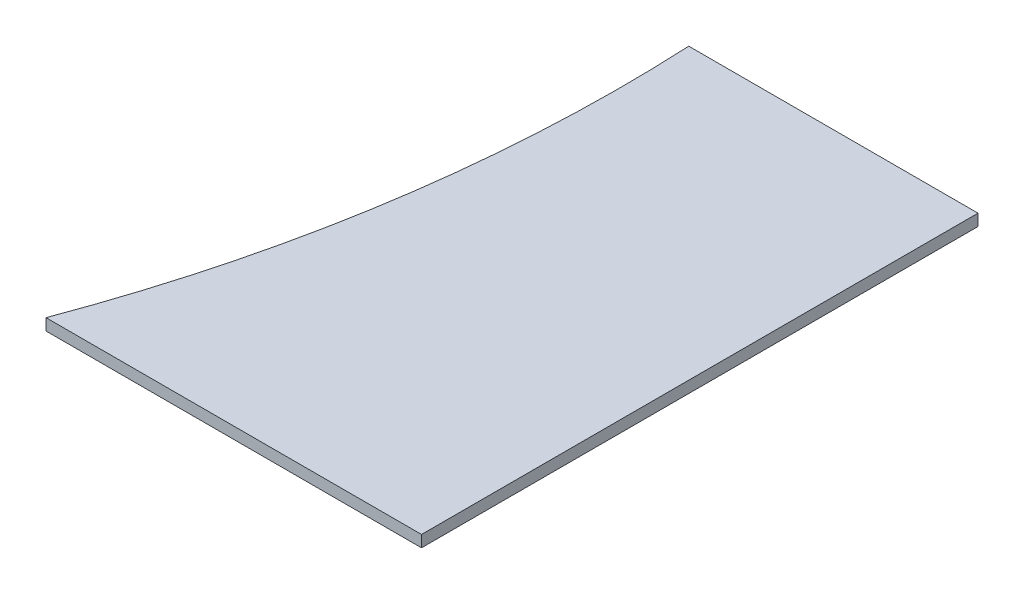
ISO-10303-21;
HEADER;
FILE_DESCRIPTION(('STEP AP214'),'2;1');
FILE_NAME('part.step','',(''),(''),'','','');
FILE_SCHEMA(('AUTOMOTIVE_DESIGN { 1 0 10303 214 1 1 1 1 }'));
ENDSEC;
DATA;
#1=APPLICATION_CONTEXT('core data for automotive mechanical design processes');
#2=APPLICATION_PROTOCOL_DEFINITION('international standard','automotive_design',2000,#1);
#3=PRODUCT_CONTEXT('',#1,'mechanical');
#4=PRODUCT('Part','Part','',(#3));
#5=PRODUCT_RELATED_PRODUCT_CATEGORY('part','',(#4));
#6=PRODUCT_DEFINITION_FORMATION('','',#4);
#7=PRODUCT_DEFINITION_CONTEXT('part definition',#1,'design');
#8=PRODUCT_DEFINITION('design','',#6,#7);
#9=PRODUCT_DEFINITION_SHAPE('','',#8);
#10=(LENGTH_UNIT() NAMED_UNIT(*) SI_UNIT(.MILLI.,.METRE.));
#11=(NAMED_UNIT(*) PLANE_ANGLE_UNIT() SI_UNIT($,.RADIAN.));
#12=(NAMED_UNIT(*) SI_UNIT($,.STERADIAN.) SOLID_ANGLE_UNIT());
#13=UNCERTAINTY_MEASURE_WITH_UNIT(LENGTH_MEASURE(1.E-05),#10,'distance_accuracy_value','');
#14=(GEOMETRIC_REPRESENTATION_CONTEXT(3) GLOBAL_UNCERTAINTY_ASSIGNED_CONTEXT((#13)) GLOBAL_UNIT_ASSIGNED_CONTEXT((#10,
#11,#12)) REPRESENTATION_CONTEXT('',''));
#15=CARTESIAN_POINT('',(0.,0.,0.));
#16=DIRECTION('',(0.,0.,1.));
#17=DIRECTION('',(1.,0.,0.));
#18=AXIS2_PLACEMENT_3D('',#15,#16,#17);
#19=CARTESIAN_POINT('',(39.37,3.175,76.2));
#20=DIRECTION('',(-1.,0.,0.));
#21=DIRECTION('',(0.,0.,1.));
#22=AXIS2_PLACEMENT_3D('',#19,#20,#21);
#23=PLANE('',#22);
#24=DIRECTION('',(0.,0.,-1.));
#25=VECTOR('',#24,1.);
#26=CARTESIAN_POINT('',(39.37,0.,76.2));
#27=LINE('',#26,#25);
#28=CARTESIAN_POINT('',(39.37,0.,76.2));
#29=VERTEX_POINT('',#28);
#30=CARTESIAN_POINT('',(39.37,0.,-76.2));
#31=VERTEX_POINT('',#30);
#32=EDGE_CURVE('E108',#29,#31,#27,.T.);
#33=ORIENTED_EDGE('',*,*,#32,.T.);
#34=DIRECTION('',(0.,-1.,0.));
#35=VECTOR('',#34,1.);
#36=CARTESIAN_POINT('',(39.37,3.175,-76.2));
#37=LINE('',#36,#35);
#38=CARTESIAN_POINT('',(39.37,3.175,-76.2));
#39=VERTEX_POINT('',#38);
#40=EDGE_CURVE('E11',#39,#31,#37,.T.);
#41=ORIENTED_EDGE('',*,*,#40,.F.);
#42=DIRECTION('',(0.,0.,-1.));
#43=VECTOR('',#42,1.);
#44=CARTESIAN_POINT('',(39.37,3.175,76.2));
#45=LINE('',#44,#43);
#46=CARTESIAN_POINT('',(39.37,3.175,76.2));
#47=VERTEX_POINT('',#46);
#48=EDGE_CURVE('E90',#47,#39,#45,.T.);
#49=ORIENTED_EDGE('',*,*,#48,.F.);
#50=DIRECTION('',(0.,-1.,0.));
#51=VECTOR('',#50,1.);
#52=CARTESIAN_POINT('',(39.37,3.175,76.2));
#53=LINE('',#52,#51);
#54=EDGE_CURVE('E104',#47,#29,#53,.T.);
#55=ORIENTED_EDGE('',*,*,#54,.T.);
#56=EDGE_LOOP('',(#33,#41,#49,#55));
#57=FACE_BOUND('',#56,.T.);
#58=ADVANCED_FACE('F39',(#57),#23,.F.);
#59=CARTESIAN_POINT('',(-39.37,3.175,-76.2));
#60=DIRECTION('',(0.,0.,1.));
#61=DIRECTION('',(1.,0.,0.));
#62=AXIS2_PLACEMENT_3D('',#59,#60,#61);
#63=PLANE('',#62);
#64=DIRECTION('',(-1.,0.,0.));
#65=VECTOR('',#64,1.);
#66=CARTESIAN_POINT('',(-39.37,0.,-76.2));
#67=LINE('',#66,#65);
#68=CARTESIAN_POINT('',(-39.8465480289027,0.,-76.2));
#69=VERTEX_POINT('',#68);
#70=EDGE_CURVE('E96',#31,#69,#67,.T.);
#71=ORIENTED_EDGE('',*,*,#70,.T.);
#72=DIRECTION('',(0.,-1.,0.));
#73=VECTOR('',#72,1.);
#74=CARTESIAN_POINT('',(-39.8465480289027,3.175,-76.2));
#75=LINE('',#74,#73);
#76=CARTESIAN_POINT('',(-39.8465480289027,3.175,-76.2));
#77=VERTEX_POINT('',#76);
#78=EDGE_CURVE('E48',#77,#69,#75,.T.);
#79=ORIENTED_EDGE('',*,*,#78,.F.);
#80=DIRECTION('',(-1.,0.,0.));
#81=VECTOR('',#80,1.);
#82=CARTESIAN_POINT('',(-39.37,3.175,-76.2));
#83=LINE('',#82,#81);
#84=EDGE_CURVE('E84',#39,#77,#83,.T.);
#85=ORIENTED_EDGE('',*,*,#84,.F.);
#86=ORIENTED_EDGE('',*,*,#40,.T.);
#87=EDGE_LOOP('',(#71,#79,#85,#86));
#88=FACE_BOUND('',#87,.T.);
#89=ADVANCED_FACE('F95',(#88),#63,.F.);
#90=CARTESIAN_POINT('',(-420.37,3.175,-57.15));
#91=DIRECTION('',(0.,-1.,0.));
#92=DIRECTION('',(0.,0.,-1.));
#93=AXIS2_PLACEMENT_3D('',#90,#91,#92);
#94=CYLINDRICAL_SURFACE('',#93,381.);
#95=CARTESIAN_POINT('',(-420.37,0.,-57.15));
#96=DIRECTION('',(0.,-1.,0.));
#97=DIRECTION('',(0.,0.,1.));
#98=AXIS2_PLACEMENT_3D('',#95,#96,#97);
#99=CIRCLE('',#98,381.);
#100=CARTESIAN_POINT('',(-63.4683643915315,0.,76.2));
#101=VERTEX_POINT('',#100);
#102=EDGE_CURVE('E114',#69,#101,#99,.T.);
#103=ORIENTED_EDGE('',*,*,#102,.T.);
#104=DIRECTION('',(0.,-1.,0.));
#105=VECTOR('',#104,1.);
#106=CARTESIAN_POINT('',(-63.4683643915315,3.175,76.2));
#107=LINE('',#106,#105);
#108=CARTESIAN_POINT('',(-63.4683643915315,3.175,76.2));
#109=VERTEX_POINT('',#108);
#110=EDGE_CURVE('E99',#109,#101,#107,.T.);
#111=ORIENTED_EDGE('',*,*,#110,.F.);
#112=CARTESIAN_POINT('',(-420.37,3.175,-57.15));
#113=DIRECTION('',(0.,-1.,0.));
#114=DIRECTION('',(0.,0.,1.));
#115=AXIS2_PLACEMENT_3D('',#112,#113,#114);
#116=CIRCLE('',#115,381.);
#117=EDGE_CURVE('E87',#77,#109,#116,.T.);
#118=ORIENTED_EDGE('',*,*,#117,.F.);
#119=ORIENTED_EDGE('',*,*,#78,.T.);
#120=EDGE_LOOP('',(#103,#111,#118,#119));
#121=FACE_BOUND('',#120,.T.);
#122=ADVANCED_FACE('F100',(#121),#94,.F.);
#123=CARTESIAN_POINT('',(-39.37,3.175,76.2));
#124=DIRECTION('',(0.,0.,-1.));
#125=DIRECTION('',(-1.,0.,0.));
#126=AXIS2_PLACEMENT_3D('',#123,#124,#125);
#127=PLANE('',#126);
#128=DIRECTION('',(1.,0.,0.));
#129=VECTOR('',#128,1.);
#130=CARTESIAN_POINT('',(-39.37,0.,76.2));
#131=LINE('',#130,#129);
#132=EDGE_CURVE('E73',#101,#29,#131,.T.);
#133=ORIENTED_EDGE('',*,*,#132,.T.);
#134=ORIENTED_EDGE('',*,*,#54,.F.);
#135=DIRECTION('',(1.,0.,0.));
#136=VECTOR('',#135,1.);
#137=CARTESIAN_POINT('',(-39.37,3.175,76.2));
#138=LINE('',#137,#136);
#139=EDGE_CURVE('E56',#109,#47,#138,.T.);
#140=ORIENTED_EDGE('',*,*,#139,.F.);
#141=ORIENTED_EDGE('',*,*,#110,.T.);
#142=EDGE_LOOP('',(#133,#134,#140,#141));
#143=FACE_BOUND('',#142,.T.);
#144=ADVANCED_FACE('F122',(#143),#127,.F.);
#145=CARTESIAN_POINT('',(-420.37,3.175,-57.15));
#146=DIRECTION('',(0.,1.,0.));
#147=DIRECTION('',(0.,0.,1.));
#148=AXIS2_PLACEMENT_3D('',#145,#146,#147);
#149=PLANE('',#148);
#150=ORIENTED_EDGE('',*,*,#48,.T.);
#151=ORIENTED_EDGE('',*,*,#84,.T.);
#152=ORIENTED_EDGE('',*,*,#117,.T.);
#153=ORIENTED_EDGE('',*,*,#139,.T.);
#154=EDGE_LOOP('',(#150,#151,#152,#153));
#155=FACE_BOUND('',#154,.T.);
#156=ADVANCED_FACE('F85',(#155),#149,.T.);
#157=CARTESIAN_POINT('',(-420.37,0.,-57.15));
#158=DIRECTION('',(0.,1.,0.));
#159=DIRECTION('',(0.,0.,1.));
#160=AXIS2_PLACEMENT_3D('',#157,#158,#159);
#161=PLANE('',#160);
#162=ORIENTED_EDGE('',*,*,#32,.F.);
#163=ORIENTED_EDGE('',*,*,#132,.F.);
#164=ORIENTED_EDGE('',*,*,#102,.F.);
#165=ORIENTED_EDGE('',*,*,#70,.F.);
#166=EDGE_LOOP('',(#162,#163,#164,#165));
#167=FACE_BOUND('',#166,.T.);
#168=ADVANCED_FACE('F125',(#167),#161,.F.);
#169=CLOSED_SHELL('',(#58,#89,#122,#144,#156,#168));
#170=MANIFOLD_SOLID_BREP('B2',#169);
#171=ADVANCED_BREP_SHAPE_REPRESENTATION('',(#18,#170),#14);
#172=SHAPE_DEFINITION_REPRESENTATION(#9,#171);
ENDSEC;
END-ISO-10303-21;
